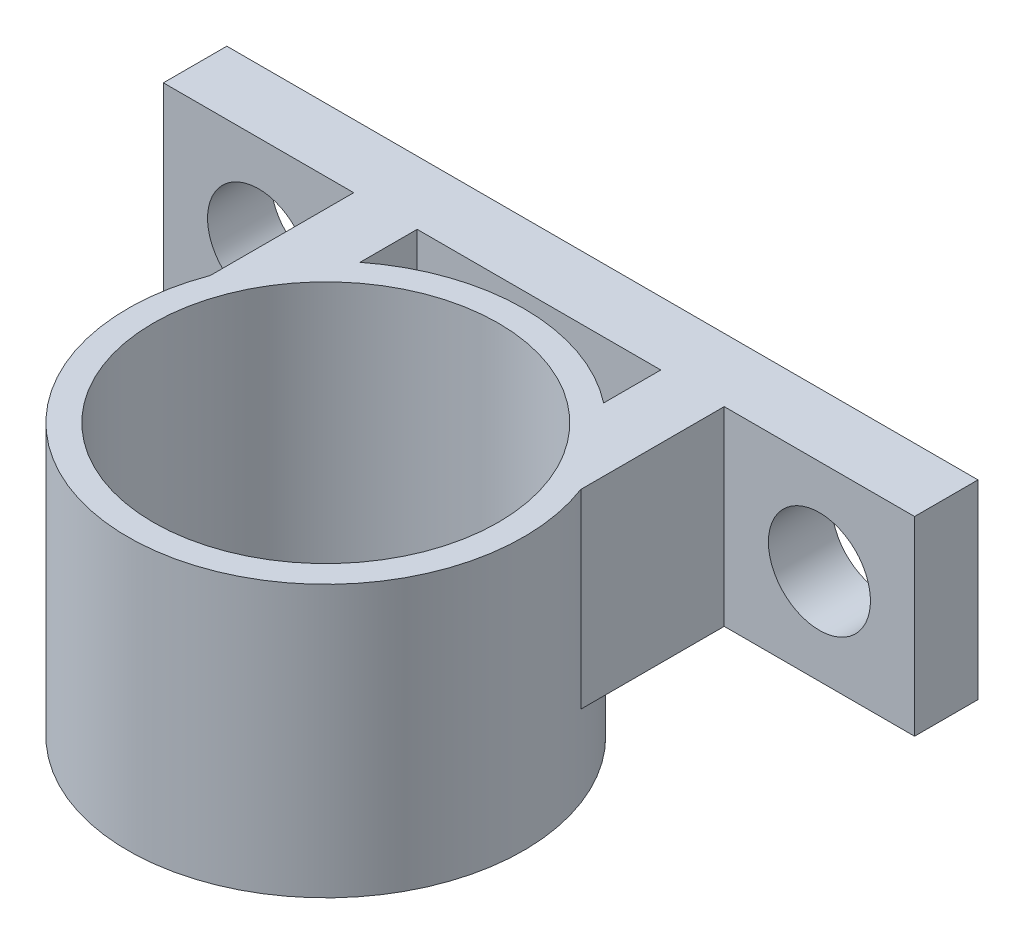
ISO-10303-21;
HEADER;
FILE_DESCRIPTION(('STEP AP214'),'2;1');
FILE_NAME('part.step','',(''),(''),'','','');
FILE_SCHEMA(('AUTOMOTIVE_DESIGN { 1 0 10303 214 1 1 1 1 }'));
ENDSEC;
DATA;
#1=APPLICATION_CONTEXT('core data for automotive mechanical design processes');
#2=APPLICATION_PROTOCOL_DEFINITION('international standard','automotive_design',2000,#1);
#3=PRODUCT_CONTEXT('',#1,'mechanical');
#4=PRODUCT('Part','Part','',(#3));
#5=PRODUCT_RELATED_PRODUCT_CATEGORY('part','',(#4));
#6=PRODUCT_DEFINITION_FORMATION('','',#4);
#7=PRODUCT_DEFINITION_CONTEXT('part definition',#1,'design');
#8=PRODUCT_DEFINITION('design','',#6,#7);
#9=PRODUCT_DEFINITION_SHAPE('','',#8);
#10=(LENGTH_UNIT() NAMED_UNIT(*) SI_UNIT(.MILLI.,.METRE.));
#11=(NAMED_UNIT(*) PLANE_ANGLE_UNIT() SI_UNIT($,.RADIAN.));
#12=(NAMED_UNIT(*) SI_UNIT($,.STERADIAN.) SOLID_ANGLE_UNIT());
#13=UNCERTAINTY_MEASURE_WITH_UNIT(LENGTH_MEASURE(1.E-05),#10,'distance_accuracy_value','');
#14=(GEOMETRIC_REPRESENTATION_CONTEXT(3) GLOBAL_UNCERTAINTY_ASSIGNED_CONTEXT((#13)) GLOBAL_UNIT_ASSIGNED_CONTEXT((#10,
#11,#12)) REPRESENTATION_CONTEXT('',''));
#15=CARTESIAN_POINT('',(0.,0.,0.));
#16=DIRECTION('',(0.,0.,1.));
#17=DIRECTION('',(1.,0.,0.));
#18=AXIS2_PLACEMENT_3D('',#15,#16,#17);
#19=CARTESIAN_POINT('',(0.,9.525,0.));
#20=DIRECTION('',(0.,-1.,0.));
#21=DIRECTION('',(0.,0.,-1.));
#22=AXIS2_PLACEMENT_3D('',#19,#20,#21);
#23=PLANE('',#22);
#24=CARTESIAN_POINT('',(0.,9.525,0.));
#25=DIRECTION('',(0.,1.,0.));
#26=DIRECTION('',(0.,0.,1.));
#27=AXIS2_PLACEMENT_3D('',#24,#25,#26);
#28=CIRCLE('',#27,8.636);
#29=CARTESIAN_POINT('',(0.,9.525,8.636));
#30=VERTEX_POINT('',#29);
#31=EDGE_CURVE('E237',#30,#30,#28,.T.);
#32=ORIENTED_EDGE('',*,*,#31,.F.);
#33=EDGE_LOOP('',(#32));
#34=FACE_BOUND('',#33,.T.);
#35=CARTESIAN_POINT('',(0.,9.525,0.));
#36=DIRECTION('',(0.,1.,0.));
#37=DIRECTION('',(0.,0.,1.));
#38=AXIS2_PLACEMENT_3D('',#35,#36,#37);
#39=CIRCLE('',#38,9.906);
#40=CARTESIAN_POINT('',(-9.271,9.525,-3.48961244266467));
#41=VERTEX_POINT('',#40);
#42=CARTESIAN_POINT('',(9.271,9.525,-3.48961244266467));
#43=VERTEX_POINT('',#42);
#44=EDGE_CURVE('E228',#41,#43,#39,.T.);
#45=ORIENTED_EDGE('',*,*,#44,.T.);
#46=DIRECTION('',(0.,0.,-1.));
#47=VECTOR('',#46,1.);
#48=CARTESIAN_POINT('',(9.271,9.525,0.));
#49=LINE('',#48,#47);
#50=CARTESIAN_POINT('',(9.271,9.525,-10.668));
#51=VERTEX_POINT('',#50);
#52=EDGE_CURVE('E53',#43,#51,#49,.T.);
#53=ORIENTED_EDGE('',*,*,#52,.T.);
#54=DIRECTION('',(1.,0.,0.));
#55=VECTOR('',#54,1.);
#56=CARTESIAN_POINT('',(9.271,9.525,-10.668));
#57=LINE('',#56,#55);
#58=CARTESIAN_POINT('',(18.796,9.525,-10.668));
#59=VERTEX_POINT('',#58);
#60=EDGE_CURVE('E162',#51,#59,#57,.T.);
#61=ORIENTED_EDGE('',*,*,#60,.T.);
#62=DIRECTION('',(0.,0.,-1.));
#63=VECTOR('',#62,1.);
#64=CARTESIAN_POINT('',(18.796,9.525,-10.668));
#65=LINE('',#64,#63);
#66=CARTESIAN_POINT('',(18.796,9.525,-13.843));
#67=VERTEX_POINT('',#66);
#68=EDGE_CURVE('E165',#59,#67,#65,.T.);
#69=ORIENTED_EDGE('',*,*,#68,.T.);
#70=DIRECTION('',(-1.,0.,0.));
#71=VECTOR('',#70,1.);
#72=CARTESIAN_POINT('',(6.096,9.525,-13.843));
#73=LINE('',#72,#71);
#74=CARTESIAN_POINT('',(-18.796,9.525,-13.843));
#75=VERTEX_POINT('',#74);
#76=EDGE_CURVE('E167',#67,#75,#73,.T.);
#77=ORIENTED_EDGE('',*,*,#76,.T.);
#78=DIRECTION('',(0.,0.,1.));
#79=VECTOR('',#78,1.);
#80=CARTESIAN_POINT('',(-18.796,9.525,-10.668));
#81=LINE('',#80,#79);
#82=CARTESIAN_POINT('',(-18.796,9.525,-10.668));
#83=VERTEX_POINT('',#82);
#84=EDGE_CURVE('E169',#75,#83,#81,.T.);
#85=ORIENTED_EDGE('',*,*,#84,.T.);
#86=DIRECTION('',(1.,0.,0.));
#87=VECTOR('',#86,1.);
#88=CARTESIAN_POINT('',(-9.271,9.525,-10.668));
#89=LINE('',#88,#87);
#90=CARTESIAN_POINT('',(-9.271,9.525,-10.668));
#91=VERTEX_POINT('',#90);
#92=EDGE_CURVE('E171',#83,#91,#89,.T.);
#93=ORIENTED_EDGE('',*,*,#92,.T.);
#94=DIRECTION('',(0.,0.,1.));
#95=VECTOR('',#94,1.);
#96=CARTESIAN_POINT('',(-9.271,9.525,0.));
#97=LINE('',#96,#95);
#98=EDGE_CURVE('E173',#91,#41,#97,.T.);
#99=ORIENTED_EDGE('',*,*,#98,.T.);
#100=EDGE_LOOP('',(#45,#53,#61,#69,#77,#85,#93,#99));
#101=FACE_BOUND('',#100,.T.);
#102=DIRECTION('',(0.,0.,-1.));
#103=VECTOR('',#102,1.);
#104=CARTESIAN_POINT('',(6.09599999999999,9.525,-6.731));
#105=LINE('',#104,#103);
#106=CARTESIAN_POINT('',(6.096,9.525,-7.80817648366122));
#107=VERTEX_POINT('',#106);
#108=CARTESIAN_POINT('',(6.096,9.525,-10.668));
#109=VERTEX_POINT('',#108);
#110=EDGE_CURVE('E125',#107,#109,#105,.T.);
#111=ORIENTED_EDGE('',*,*,#110,.F.);
#112=CARTESIAN_POINT('',(-6.096,9.525,-7.80817648366122));
#113=VERTEX_POINT('',#112);
#114=EDGE_CURVE('E232',#107,#113,#39,.T.);
#115=ORIENTED_EDGE('',*,*,#114,.T.);
#116=DIRECTION('',(0.,0.,1.));
#117=VECTOR('',#116,1.);
#118=CARTESIAN_POINT('',(-6.09599999999999,9.525,-6.731));
#119=LINE('',#118,#117);
#120=CARTESIAN_POINT('',(-6.096,9.525,-10.668));
#121=VERTEX_POINT('',#120);
#122=EDGE_CURVE('E149',#121,#113,#119,.T.);
#123=ORIENTED_EDGE('',*,*,#122,.F.);
#124=DIRECTION('',(-1.,0.,0.));
#125=VECTOR('',#124,1.);
#126=CARTESIAN_POINT('',(-6.096,9.525,-10.668));
#127=LINE('',#126,#125);
#128=EDGE_CURVE('E137',#109,#121,#127,.T.);
#129=ORIENTED_EDGE('',*,*,#128,.F.);
#130=EDGE_LOOP('',(#111,#115,#123,#129));
#131=FACE_BOUND('',#130,.T.);
#132=ADVANCED_FACE('F38',(#34,#101,#131),#23,.F.);
#133=CARTESIAN_POINT('',(0.,0.,0.));
#134=DIRECTION('',(0.,-1.,0.));
#135=DIRECTION('',(0.,0.,-1.));
#136=AXIS2_PLACEMENT_3D('',#133,#134,#135);
#137=PLANE('',#136);
#138=CARTESIAN_POINT('',(0.,0.,0.));
#139=DIRECTION('',(0.,-1.,0.));
#140=DIRECTION('',(0.,0.,-1.));
#141=AXIS2_PLACEMENT_3D('',#138,#139,#140);
#142=CIRCLE('',#141,9.906);
#143=CARTESIAN_POINT('',(6.096,0.,-7.80817648366122));
#144=VERTEX_POINT('',#143);
#145=CARTESIAN_POINT('',(9.271,0.,-3.48961244266468));
#146=VERTEX_POINT('',#145);
#147=EDGE_CURVE('E244',#144,#146,#142,.T.);
#148=ORIENTED_EDGE('',*,*,#147,.F.);
#149=DIRECTION('',(0.,0.,-1.));
#150=VECTOR('',#149,1.);
#151=CARTESIAN_POINT('',(6.09599999999999,0.,-6.731));
#152=LINE('',#151,#150);
#153=CARTESIAN_POINT('',(6.096,0.,-10.668));
#154=VERTEX_POINT('',#153);
#155=EDGE_CURVE('E154',#144,#154,#152,.T.);
#156=ORIENTED_EDGE('',*,*,#155,.T.);
#157=DIRECTION('',(-1.,0.,0.));
#158=VECTOR('',#157,1.);
#159=CARTESIAN_POINT('',(-6.096,0.,-10.668));
#160=LINE('',#159,#158);
#161=CARTESIAN_POINT('',(-6.096,0.,-10.668));
#162=VERTEX_POINT('',#161);
#163=EDGE_CURVE('E145',#154,#162,#160,.T.);
#164=ORIENTED_EDGE('',*,*,#163,.T.);
#165=DIRECTION('',(0.,0.,1.));
#166=VECTOR('',#165,1.);
#167=CARTESIAN_POINT('',(-6.09599999999999,0.,-6.731));
#168=LINE('',#167,#166);
#169=CARTESIAN_POINT('',(-6.096,0.,-7.80817648366122));
#170=VERTEX_POINT('',#169);
#171=EDGE_CURVE('E138',#162,#170,#168,.T.);
#172=ORIENTED_EDGE('',*,*,#171,.T.);
#173=CARTESIAN_POINT('',(-9.271,0.,-3.48961244266468));
#174=VERTEX_POINT('',#173);
#175=EDGE_CURVE('E235',#174,#170,#142,.T.);
#176=ORIENTED_EDGE('',*,*,#175,.F.);
#177=DIRECTION('',(0.,0.,1.));
#178=VECTOR('',#177,1.);
#179=CARTESIAN_POINT('',(-9.271,0.,0.));
#180=LINE('',#179,#178);
#181=CARTESIAN_POINT('',(-9.271,0.,-10.668));
#182=VERTEX_POINT('',#181);
#183=EDGE_CURVE('E163',#182,#174,#180,.T.);
#184=ORIENTED_EDGE('',*,*,#183,.F.);
#185=DIRECTION('',(1.,0.,0.));
#186=VECTOR('',#185,1.);
#187=CARTESIAN_POINT('',(-9.271,0.,-10.668));
#188=LINE('',#187,#186);
#189=CARTESIAN_POINT('',(-18.796,0.,-10.668));
#190=VERTEX_POINT('',#189);
#191=EDGE_CURVE('E187',#190,#182,#188,.T.);
#192=ORIENTED_EDGE('',*,*,#191,.F.);
#193=DIRECTION('',(0.,0.,1.));
#194=VECTOR('',#193,1.);
#195=CARTESIAN_POINT('',(-18.796,0.,-10.668));
#196=LINE('',#195,#194);
#197=CARTESIAN_POINT('',(-18.796,0.,-13.843));
#198=VERTEX_POINT('',#197);
#199=EDGE_CURVE('E185',#198,#190,#196,.T.);
#200=ORIENTED_EDGE('',*,*,#199,.F.);
#201=DIRECTION('',(-1.,0.,0.));
#202=VECTOR('',#201,1.);
#203=CARTESIAN_POINT('',(-6.096,0.,-13.843));
#204=LINE('',#203,#202);
#205=CARTESIAN_POINT('',(18.796,0.,-13.843));
#206=VERTEX_POINT('',#205);
#207=EDGE_CURVE('E183',#206,#198,#204,.T.);
#208=ORIENTED_EDGE('',*,*,#207,.F.);
#209=DIRECTION('',(0.,0.,-1.));
#210=VECTOR('',#209,1.);
#211=CARTESIAN_POINT('',(18.796,0.,-10.668));
#212=LINE('',#211,#210);
#213=CARTESIAN_POINT('',(18.796,0.,-10.668));
#214=VERTEX_POINT('',#213);
#215=EDGE_CURVE('E180',#214,#206,#212,.T.);
#216=ORIENTED_EDGE('',*,*,#215,.F.);
#217=DIRECTION('',(1.,0.,0.));
#218=VECTOR('',#217,1.);
#219=CARTESIAN_POINT('',(9.271,0.,-10.668));
#220=LINE('',#219,#218);
#221=CARTESIAN_POINT('',(9.271,0.,-10.668));
#222=VERTEX_POINT('',#221);
#223=EDGE_CURVE('E178',#222,#214,#220,.T.);
#224=ORIENTED_EDGE('',*,*,#223,.F.);
#225=DIRECTION('',(0.,0.,-1.));
#226=VECTOR('',#225,1.);
#227=CARTESIAN_POINT('',(9.271,0.,0.));
#228=LINE('',#227,#226);
#229=EDGE_CURVE('E146',#146,#222,#228,.T.);
#230=ORIENTED_EDGE('',*,*,#229,.F.);
#231=EDGE_LOOP('',(#148,#156,#164,#172,#176,#184,#192,#200,#208,#216,#224,#230));
#232=FACE_BOUND('',#231,.T.);
#233=ADVANCED_FACE('F212',(#232),#137,.T.);
#234=CARTESIAN_POINT('',(9.271,9.525,0.));
#235=DIRECTION('',(-1.,0.,0.));
#236=DIRECTION('',(0.,0.,1.));
#237=AXIS2_PLACEMENT_3D('',#234,#235,#236);
#238=PLANE('',#237);
#239=ORIENTED_EDGE('',*,*,#52,.F.);
#240=DIRECTION('',(0.,1.,0.));
#241=VECTOR('',#240,1.);
#242=CARTESIAN_POINT('',(9.271,-30.8123990977358,-3.48961244266468));
#243=LINE('',#242,#241);
#244=EDGE_CURVE('E57',#43,#146,#243,.F.);
#245=ORIENTED_EDGE('',*,*,#244,.T.);
#246=ORIENTED_EDGE('',*,*,#229,.T.);
#247=DIRECTION('',(0.,-1.,0.));
#248=VECTOR('',#247,1.);
#249=CARTESIAN_POINT('',(9.271,9.525,-10.668));
#250=LINE('',#249,#248);
#251=EDGE_CURVE('E46',#51,#222,#250,.T.);
#252=ORIENTED_EDGE('',*,*,#251,.F.);
#253=EDGE_LOOP('',(#239,#245,#246,#252));
#254=FACE_BOUND('',#253,.T.);
#255=ADVANCED_FACE('F40',(#254),#238,.F.);
#256=CARTESIAN_POINT('',(9.271,9.525,-10.668));
#257=DIRECTION('',(0.,0.,-1.));
#258=DIRECTION('',(-1.,0.,0.));
#259=AXIS2_PLACEMENT_3D('',#256,#257,#258);
#260=PLANE('',#259);
#261=CARTESIAN_POINT('',(14.0335,4.7625,-10.668));
#262=DIRECTION('',(0.,0.,1.));
#263=DIRECTION('',(-1.,0.,0.));
#264=AXIS2_PLACEMENT_3D('',#261,#262,#263);
#265=CIRCLE('',#264,2.5527);
#266=CARTESIAN_POINT('',(11.4808,4.7625,-10.668));
#267=VERTEX_POINT('',#266);
#268=EDGE_CURVE('E248',#267,#267,#265,.T.);
#269=ORIENTED_EDGE('',*,*,#268,.F.);
#270=EDGE_LOOP('',(#269));
#271=FACE_BOUND('',#270,.T.);
#272=ORIENTED_EDGE('',*,*,#223,.T.);
#273=DIRECTION('',(0.,-1.,0.));
#274=VECTOR('',#273,1.);
#275=CARTESIAN_POINT('',(18.796,9.525,-10.668));
#276=LINE('',#275,#274);
#277=EDGE_CURVE('E202',#59,#214,#276,.T.);
#278=ORIENTED_EDGE('',*,*,#277,.F.);
#279=ORIENTED_EDGE('',*,*,#60,.F.);
#280=ORIENTED_EDGE('',*,*,#251,.T.);
#281=EDGE_LOOP('',(#272,#278,#279,#280));
#282=FACE_BOUND('',#281,.T.);
#283=ADVANCED_FACE('F208',(#271,#282),#260,.F.);
#284=CARTESIAN_POINT('',(18.796,9.525,-10.668));
#285=DIRECTION('',(-1.,0.,0.));
#286=DIRECTION('',(0.,0.,1.));
#287=AXIS2_PLACEMENT_3D('',#284,#285,#286);
#288=PLANE('',#287);
#289=ORIENTED_EDGE('',*,*,#215,.T.);
#290=DIRECTION('',(0.,-1.,0.));
#291=VECTOR('',#290,1.);
#292=CARTESIAN_POINT('',(18.796,9.525,-13.843));
#293=LINE('',#292,#291);
#294=EDGE_CURVE('E199',#67,#206,#293,.T.);
#295=ORIENTED_EDGE('',*,*,#294,.F.);
#296=ORIENTED_EDGE('',*,*,#68,.F.);
#297=ORIENTED_EDGE('',*,*,#277,.T.);
#298=EDGE_LOOP('',(#289,#295,#296,#297));
#299=FACE_BOUND('',#298,.T.);
#300=ADVANCED_FACE('F217',(#299),#288,.F.);
#301=CARTESIAN_POINT('',(-6.096,9.525,-13.843));
#302=DIRECTION('',(0.,0.,1.));
#303=DIRECTION('',(1.,0.,0.));
#304=AXIS2_PLACEMENT_3D('',#301,#302,#303);
#305=PLANE('',#304);
#306=CARTESIAN_POINT('',(-14.0335,4.7625,-13.843));
#307=DIRECTION('',(0.,0.,1.));
#308=DIRECTION('',(1.,0.,0.));
#309=AXIS2_PLACEMENT_3D('',#306,#307,#308);
#310=CIRCLE('',#309,2.5527);
#311=CARTESIAN_POINT('',(-11.4808,4.7625,-13.843));
#312=VERTEX_POINT('',#311);
#313=EDGE_CURVE('E156',#312,#312,#310,.T.);
#314=ORIENTED_EDGE('',*,*,#313,.T.);
#315=EDGE_LOOP('',(#314));
#316=FACE_BOUND('',#315,.T.);
#317=CARTESIAN_POINT('',(14.0335,4.7625,-13.843));
#318=DIRECTION('',(0.,0.,1.));
#319=DIRECTION('',(-1.,0.,0.));
#320=AXIS2_PLACEMENT_3D('',#317,#318,#319);
#321=CIRCLE('',#320,2.5527);
#322=CARTESIAN_POINT('',(11.4808,4.7625,-13.843));
#323=VERTEX_POINT('',#322);
#324=EDGE_CURVE('E254',#323,#323,#321,.T.);
#325=ORIENTED_EDGE('',*,*,#324,.T.);
#326=EDGE_LOOP('',(#325));
#327=FACE_BOUND('',#326,.T.);
#328=ORIENTED_EDGE('',*,*,#207,.T.);
#329=DIRECTION('',(0.,-1.,0.));
#330=VECTOR('',#329,1.);
#331=CARTESIAN_POINT('',(-18.796,9.525,-13.843));
#332=LINE('',#331,#330);
#333=EDGE_CURVE('E196',#75,#198,#332,.T.);
#334=ORIENTED_EDGE('',*,*,#333,.F.);
#335=ORIENTED_EDGE('',*,*,#76,.F.);
#336=ORIENTED_EDGE('',*,*,#294,.T.);
#337=EDGE_LOOP('',(#328,#334,#335,#336));
#338=FACE_BOUND('',#337,.T.);
#339=ADVANCED_FACE('F221',(#316,#327,#338),#305,.F.);
#340=CARTESIAN_POINT('',(-18.796,9.525,-10.668));
#341=DIRECTION('',(1.,0.,0.));
#342=DIRECTION('',(0.,0.,-1.));
#343=AXIS2_PLACEMENT_3D('',#340,#341,#342);
#344=PLANE('',#343);
#345=ORIENTED_EDGE('',*,*,#199,.T.);
#346=DIRECTION('',(0.,-1.,0.));
#347=VECTOR('',#346,1.);
#348=CARTESIAN_POINT('',(-18.796,9.525,-10.668));
#349=LINE('',#348,#347);
#350=EDGE_CURVE('E193',#83,#190,#349,.T.);
#351=ORIENTED_EDGE('',*,*,#350,.F.);
#352=ORIENTED_EDGE('',*,*,#84,.F.);
#353=ORIENTED_EDGE('',*,*,#333,.T.);
#354=EDGE_LOOP('',(#345,#351,#352,#353));
#355=FACE_BOUND('',#354,.T.);
#356=ADVANCED_FACE('F285',(#355),#344,.F.);
#357=CARTESIAN_POINT('',(-9.271,9.525,-10.668));
#358=DIRECTION('',(0.,0.,-1.));
#359=DIRECTION('',(-1.,0.,0.));
#360=AXIS2_PLACEMENT_3D('',#357,#358,#359);
#361=PLANE('',#360);
#362=CARTESIAN_POINT('',(-14.0335,4.7625,-10.668));
#363=DIRECTION('',(0.,0.,1.));
#364=DIRECTION('',(1.,0.,0.));
#365=AXIS2_PLACEMENT_3D('',#362,#363,#364);
#366=CIRCLE('',#365,2.5527);
#367=CARTESIAN_POINT('',(-11.4808,4.7625,-10.668));
#368=VERTEX_POINT('',#367);
#369=EDGE_CURVE('E251',#368,#368,#366,.T.);
#370=ORIENTED_EDGE('',*,*,#369,.F.);
#371=EDGE_LOOP('',(#370));
#372=FACE_BOUND('',#371,.T.);
#373=ORIENTED_EDGE('',*,*,#191,.T.);
#374=DIRECTION('',(0.,-1.,0.));
#375=VECTOR('',#374,1.);
#376=CARTESIAN_POINT('',(-9.271,9.525,-10.668));
#377=LINE('',#376,#375);
#378=EDGE_CURVE('E176',#91,#182,#377,.T.);
#379=ORIENTED_EDGE('',*,*,#378,.F.);
#380=ORIENTED_EDGE('',*,*,#92,.F.);
#381=ORIENTED_EDGE('',*,*,#350,.T.);
#382=EDGE_LOOP('',(#373,#379,#380,#381));
#383=FACE_BOUND('',#382,.T.);
#384=ADVANCED_FACE('F281',(#372,#383),#361,.F.);
#385=CARTESIAN_POINT('',(-9.271,9.525,0.));
#386=DIRECTION('',(1.,0.,0.));
#387=DIRECTION('',(0.,0.,-1.));
#388=AXIS2_PLACEMENT_3D('',#385,#386,#387);
#389=PLANE('',#388);
#390=ORIENTED_EDGE('',*,*,#183,.T.);
#391=DIRECTION('',(0.,1.,0.));
#392=VECTOR('',#391,1.);
#393=CARTESIAN_POINT('',(-9.271,-30.8123990977358,-3.48961244266468));
#394=LINE('',#393,#392);
#395=EDGE_CURVE('E243',#174,#41,#394,.T.);
#396=ORIENTED_EDGE('',*,*,#395,.T.);
#397=ORIENTED_EDGE('',*,*,#98,.F.);
#398=ORIENTED_EDGE('',*,*,#378,.T.);
#399=EDGE_LOOP('',(#390,#396,#397,#398));
#400=FACE_BOUND('',#399,.T.);
#401=ADVANCED_FACE('F278',(#400),#389,.F.);
#402=CARTESIAN_POINT('',(6.09599999999999,9.525,-6.731));
#403=DIRECTION('',(-1.,0.,0.));
#404=DIRECTION('',(0.,0.,1.));
#405=AXIS2_PLACEMENT_3D('',#402,#403,#404);
#406=PLANE('',#405);
#407=DIRECTION('',(0.,1.,0.));
#408=VECTOR('',#407,1.);
#409=CARTESIAN_POINT('',(6.09599999999999,-30.8123990977358,-7.80817648366122));
#410=LINE('',#409,#408);
#411=EDGE_CURVE('E132',#107,#144,#410,.F.);
#412=ORIENTED_EDGE('',*,*,#411,.F.);
#413=ORIENTED_EDGE('',*,*,#110,.T.);
#414=DIRECTION('',(0.,-1.,0.));
#415=VECTOR('',#414,1.);
#416=CARTESIAN_POINT('',(6.096,9.525,-10.668));
#417=LINE('',#416,#415);
#418=EDGE_CURVE('E129',#109,#154,#417,.T.);
#419=ORIENTED_EDGE('',*,*,#418,.T.);
#420=ORIENTED_EDGE('',*,*,#155,.F.);
#421=EDGE_LOOP('',(#412,#413,#419,#420));
#422=FACE_BOUND('',#421,.T.);
#423=ADVANCED_FACE('F127',(#422),#406,.T.);
#424=CARTESIAN_POINT('',(-6.096,9.525,-10.668));
#425=DIRECTION('',(0.,0.,1.));
#426=DIRECTION('',(1.,0.,0.));
#427=AXIS2_PLACEMENT_3D('',#424,#425,#426);
#428=PLANE('',#427);
#429=ORIENTED_EDGE('',*,*,#163,.F.);
#430=ORIENTED_EDGE('',*,*,#418,.F.);
#431=ORIENTED_EDGE('',*,*,#128,.T.);
#432=DIRECTION('',(0.,-1.,0.));
#433=VECTOR('',#432,1.);
#434=CARTESIAN_POINT('',(-6.096,9.525,-10.668));
#435=LINE('',#434,#433);
#436=EDGE_CURVE('E147',#121,#162,#435,.T.);
#437=ORIENTED_EDGE('',*,*,#436,.T.);
#438=EDGE_LOOP('',(#429,#430,#431,#437));
#439=FACE_BOUND('',#438,.T.);
#440=ADVANCED_FACE('F142',(#439),#428,.T.);
#441=CARTESIAN_POINT('',(-6.09599999999999,9.525,-6.731));
#442=DIRECTION('',(1.,0.,0.));
#443=DIRECTION('',(0.,0.,-1.));
#444=AXIS2_PLACEMENT_3D('',#441,#442,#443);
#445=PLANE('',#444);
#446=DIRECTION('',(0.,1.,0.));
#447=VECTOR('',#446,1.);
#448=CARTESIAN_POINT('',(-6.09599999999999,-30.8123990977358,-7.80817648366122));
#449=LINE('',#448,#447);
#450=EDGE_CURVE('E12',#170,#113,#449,.T.);
#451=ORIENTED_EDGE('',*,*,#450,.F.);
#452=ORIENTED_EDGE('',*,*,#171,.F.);
#453=ORIENTED_EDGE('',*,*,#436,.F.);
#454=ORIENTED_EDGE('',*,*,#122,.T.);
#455=EDGE_LOOP('',(#451,#452,#453,#454));
#456=FACE_BOUND('',#455,.T.);
#457=ADVANCED_FACE('F308',(#456),#445,.T.);
#458=CARTESIAN_POINT('',(-14.0335,4.7625,-13.843));
#459=DIRECTION('',(0.,0.,1.));
#460=DIRECTION('',(1.,0.,0.));
#461=AXIS2_PLACEMENT_3D('',#458,#459,#460);
#462=CYLINDRICAL_SURFACE('',#461,2.5527);
#463=ORIENTED_EDGE('',*,*,#313,.F.);
#464=EDGE_LOOP('',(#463));
#465=FACE_BOUND('',#464,.T.);
#466=ORIENTED_EDGE('',*,*,#369,.T.);
#467=EDGE_LOOP('',(#466));
#468=FACE_BOUND('',#467,.T.);
#469=ADVANCED_FACE('F300',(#465,#468),#462,.F.);
#470=CARTESIAN_POINT('',(14.0335,4.7625,-13.843));
#471=DIRECTION('',(0.,0.,1.));
#472=DIRECTION('',(1.,0.,0.));
#473=AXIS2_PLACEMENT_3D('',#470,#471,#472);
#474=CYLINDRICAL_SURFACE('',#473,2.5527);
#475=ORIENTED_EDGE('',*,*,#324,.F.);
#476=EDGE_LOOP('',(#475));
#477=FACE_BOUND('',#476,.T.);
#478=ORIENTED_EDGE('',*,*,#268,.T.);
#479=EDGE_LOOP('',(#478));
#480=FACE_BOUND('',#479,.T.);
#481=ADVANCED_FACE('F259',(#477,#480),#474,.F.);
#482=CARTESIAN_POINT('',(0.,-30.8123990977358,0.));
#483=DIRECTION('',(0.,1.,0.));
#484=DIRECTION('',(0.,0.,1.));
#485=AXIS2_PLACEMENT_3D('',#482,#483,#484);
#486=CYLINDRICAL_SURFACE('',#485,9.906);
#487=ORIENTED_EDGE('',*,*,#244,.F.);
#488=ORIENTED_EDGE('',*,*,#44,.F.);
#489=ORIENTED_EDGE('',*,*,#395,.F.);
#490=ORIENTED_EDGE('',*,*,#175,.T.);
#491=ORIENTED_EDGE('',*,*,#450,.T.);
#492=ORIENTED_EDGE('',*,*,#114,.F.);
#493=ORIENTED_EDGE('',*,*,#411,.T.);
#494=ORIENTED_EDGE('',*,*,#147,.T.);
#495=EDGE_LOOP('',(#487,#488,#489,#490,#491,#492,#493,#494));
#496=FACE_BOUND('',#495,.T.);
#497=CARTESIAN_POINT('',(0.,-4.064,0.));
#498=DIRECTION('',(0.,-1.,0.));
#499=DIRECTION('',(0.,0.,-1.));
#500=AXIS2_PLACEMENT_3D('',#497,#498,#499);
#501=CIRCLE('',#500,9.906);
#502=CARTESIAN_POINT('',(0.,-4.064,-9.906));
#503=VERTEX_POINT('',#502);
#504=EDGE_CURVE('E439',#503,#503,#501,.T.);
#505=ORIENTED_EDGE('',*,*,#504,.F.);
#506=EDGE_LOOP('',(#505));
#507=FACE_BOUND('',#506,.T.);
#508=ADVANCED_FACE('F299',(#496,#507),#486,.T.);
#509=CARTESIAN_POINT('',(0.,-27.2202966493081,0.));
#510=DIRECTION('',(0.,1.,0.));
#511=DIRECTION('',(0.,0.,1.));
#512=AXIS2_PLACEMENT_3D('',#509,#510,#511);
#513=CYLINDRICAL_SURFACE('',#512,8.636);
#514=ORIENTED_EDGE('',*,*,#31,.T.);
#515=EDGE_LOOP('',(#514));
#516=FACE_BOUND('',#515,.T.);
#517=CARTESIAN_POINT('',(0.,-2.794,0.));
#518=DIRECTION('',(0.,-1.,0.));
#519=DIRECTION('',(0.,0.,-1.));
#520=AXIS2_PLACEMENT_3D('',#517,#518,#519);
#521=CIRCLE('',#520,8.636);
#522=CARTESIAN_POINT('',(0.,-2.794,-8.636));
#523=VERTEX_POINT('',#522);
#524=EDGE_CURVE('E233',#523,#523,#521,.F.);
#525=ORIENTED_EDGE('',*,*,#524,.F.);
#526=EDGE_LOOP('',(#525));
#527=FACE_BOUND('',#526,.T.);
#528=ADVANCED_FACE('F306',(#516,#527),#513,.F.);
#529=CARTESIAN_POINT('',(0.,-2.794,0.));
#530=DIRECTION('',(0.,-1.,0.));
#531=DIRECTION('',(0.,0.,-1.));
#532=AXIS2_PLACEMENT_3D('',#529,#530,#531);
#533=PLANE('',#532);
#534=CARTESIAN_POINT('',(0.,-2.794,0.));
#535=DIRECTION('',(0.,-1.,0.));
#536=DIRECTION('',(0.,0.,-1.));
#537=AXIS2_PLACEMENT_3D('',#534,#535,#536);
#538=CIRCLE('',#537,7.366);
#539=CARTESIAN_POINT('',(0.,-2.794,-7.366));
#540=VERTEX_POINT('',#539);
#541=EDGE_CURVE('E437',#540,#540,#538,.T.);
#542=ORIENTED_EDGE('',*,*,#541,.T.);
#543=EDGE_LOOP('',(#542));
#544=FACE_BOUND('',#543,.T.);
#545=ORIENTED_EDGE('',*,*,#524,.T.);
#546=EDGE_LOOP('',(#545));
#547=FACE_BOUND('',#546,.T.);
#548=ADVANCED_FACE('F396',(#544,#547),#533,.F.);
#549=CARTESIAN_POINT('',(0.,-4.064,0.));
#550=DIRECTION('',(0.,-1.,0.));
#551=DIRECTION('',(0.,0.,-1.));
#552=AXIS2_PLACEMENT_3D('',#549,#550,#551);
#553=PLANE('',#552);
#554=ORIENTED_EDGE('',*,*,#504,.T.);
#555=EDGE_LOOP('',(#554));
#556=FACE_BOUND('',#555,.T.);
#557=CARTESIAN_POINT('',(0.,-4.064,0.));
#558=DIRECTION('',(0.,-1.,0.));
#559=DIRECTION('',(0.,0.,-1.));
#560=AXIS2_PLACEMENT_3D('',#557,#558,#559);
#561=CIRCLE('',#560,7.366);
#562=CARTESIAN_POINT('',(0.,-4.064,-7.366));
#563=VERTEX_POINT('',#562);
#564=EDGE_CURVE('E434',#563,#563,#561,.T.);
#565=ORIENTED_EDGE('',*,*,#564,.F.);
#566=EDGE_LOOP('',(#565));
#567=FACE_BOUND('',#566,.T.);
#568=ADVANCED_FACE('F407',(#556,#567),#553,.T.);
#569=CARTESIAN_POINT('',(0.,-4.064,0.));
#570=DIRECTION('',(0.,1.,0.));
#571=DIRECTION('',(0.,0.,1.));
#572=AXIS2_PLACEMENT_3D('',#569,#570,#571);
#573=CYLINDRICAL_SURFACE('',#572,7.366);
#574=ORIENTED_EDGE('',*,*,#564,.T.);
#575=EDGE_LOOP('',(#574));
#576=FACE_BOUND('',#575,.T.);
#577=ORIENTED_EDGE('',*,*,#541,.F.);
#578=EDGE_LOOP('',(#577));
#579=FACE_BOUND('',#578,.T.);
#580=ADVANCED_FACE('F417',(#576,#579),#573,.F.);
#581=CLOSED_SHELL('',(#132,#233,#255,#283,#300,#339,#356,#384,#401,#423,#440,#457,#469,#481,
#508,#528,#548,#568,#580));
#582=MANIFOLD_SOLID_BREP('B2',#581);
#583=ADVANCED_BREP_SHAPE_REPRESENTATION('',(#18,#582),#14);
#584=SHAPE_DEFINITION_REPRESENTATION(#9,#583);
ENDSEC;
END-ISO-10303-21;
